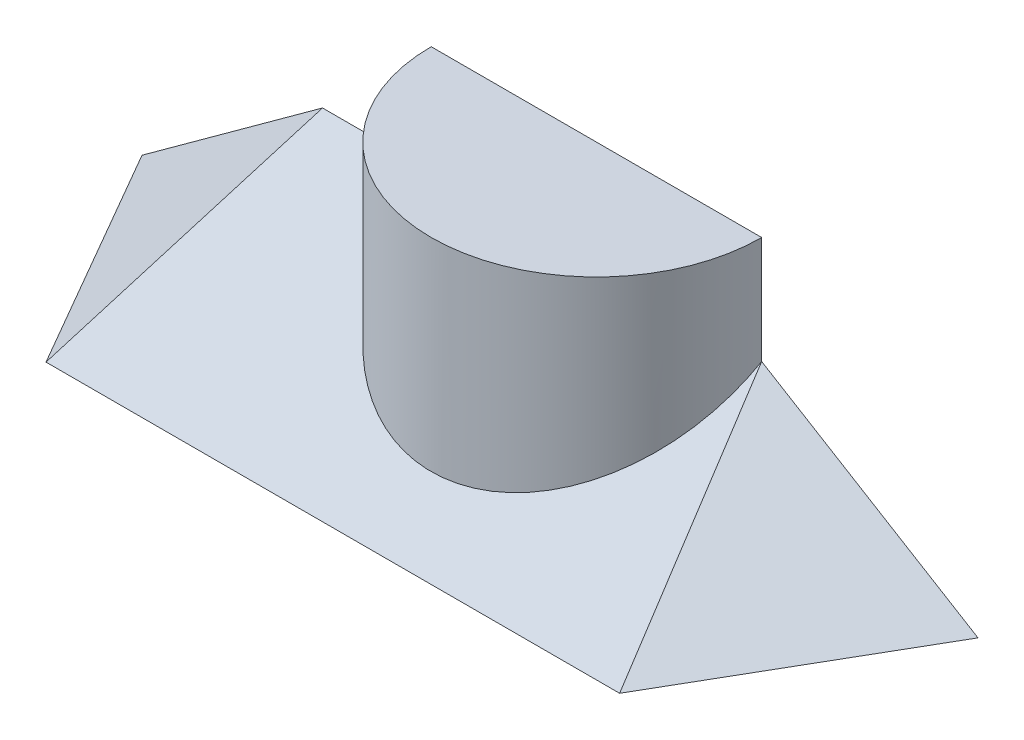
ISO-10303-21;
HEADER;
FILE_DESCRIPTION(('STEP AP214'),'2;1');
FILE_NAME('part.step','',(''),(''),'','','');
FILE_SCHEMA(('AUTOMOTIVE_DESIGN { 1 0 10303 214 1 1 1 1 }'));
ENDSEC;
DATA;
#1=APPLICATION_CONTEXT('core data for automotive mechanical design processes');
#2=APPLICATION_PROTOCOL_DEFINITION('international standard','automotive_design',2000,#1);
#3=PRODUCT_CONTEXT('',#1,'mechanical');
#4=PRODUCT('Part','Part','',(#3));
#5=PRODUCT_RELATED_PRODUCT_CATEGORY('part','',(#4));
#6=PRODUCT_DEFINITION_FORMATION('','',#4);
#7=PRODUCT_DEFINITION_CONTEXT('part definition',#1,'design');
#8=PRODUCT_DEFINITION('design','',#6,#7);
#9=PRODUCT_DEFINITION_SHAPE('','',#8);
#10=(LENGTH_UNIT() NAMED_UNIT(*) SI_UNIT(.MILLI.,.METRE.));
#11=(NAMED_UNIT(*) PLANE_ANGLE_UNIT() SI_UNIT($,.RADIAN.));
#12=(NAMED_UNIT(*) SI_UNIT($,.STERADIAN.) SOLID_ANGLE_UNIT());
#13=UNCERTAINTY_MEASURE_WITH_UNIT(LENGTH_MEASURE(1.E-05),#10,'distance_accuracy_value','');
#14=(GEOMETRIC_REPRESENTATION_CONTEXT(3) GLOBAL_UNCERTAINTY_ASSIGNED_CONTEXT((#13)) GLOBAL_UNIT_ASSIGNED_CONTEXT((#10,
#11,#12)) REPRESENTATION_CONTEXT('',''));
#15=CARTESIAN_POINT('',(0.,0.,0.));
#16=DIRECTION('',(0.,0.,1.));
#17=DIRECTION('',(1.,0.,0.));
#18=AXIS2_PLACEMENT_3D('',#15,#16,#17);
#19=CARTESIAN_POINT('',(-78.25,31.754264805429,0.));
#20=DIRECTION('',(0.,0.866025403784442,0.499999999999995));
#21=DIRECTION('',(0.,-0.499999999999995,0.866025403784442));
#22=AXIS2_PLACEMENT_3D('',#19,#20,#21);
#23=PLANE('',#22);
#24=DIRECTION('',(-1.,0.,0.));
#25=VECTOR('',#24,1.);
#26=CARTESIAN_POINT('',(-78.25,31.7531986040715,0.00184671492222538));
#27=LINE('',#26,#25);
#28=CARTESIAN_POINT('',(40.000692053466,31.7531986040716,0.0018467149222115));
#29=VERTEX_POINT('',#28);
#30=CARTESIAN_POINT('',(39.9999999573705,31.7531986040715,0.00184671492222538));
#31=VERTEX_POINT('',#30);
#32=EDGE_CURVE('E52',#29,#31,#27,.T.);
#33=ORIENTED_EDGE('',*,*,#32,.T.);
#34=CARTESIAN_POINT('',(0.,31.754264805429,0.));
#35=DIRECTION('',(0.,0.866025403784442,0.499999999999995));
#36=DIRECTION('',(0.,-0.499999999999995,0.866025403784442));
#37=AXIS2_PLACEMENT_3D('',#34,#35,#36);
#38=ELLIPSE('',#37,46.1880215351699,40.);
#39=CARTESIAN_POINT('',(-39.9999999573705,31.7531986040716,0.00184671492222538));
#40=VERTEX_POINT('',#39);
#41=EDGE_CURVE('E107',#31,#40,#38,.F.);
#42=ORIENTED_EDGE('',*,*,#41,.T.);
#43=CARTESIAN_POINT('',(-66.3070340950467,31.7531986040715,0.00184671492223232));
#44=VERTEX_POINT('',#43);
#45=EDGE_CURVE('E118',#40,#44,#27,.T.);
#46=ORIENTED_EDGE('',*,*,#45,.T.);
#47=DIRECTION('',(0.184819464600236,0.491386244594021,-0.851105941777325));
#48=VECTOR('',#47,1.);
#49=CARTESIAN_POINT('',(-78.2504292636308,-0.00114129885577733,55.0019767876049));
#50=LINE('',#49,#48);
#51=CARTESIAN_POINT('',(-78.25,0.,55.));
#52=VERTEX_POINT('',#51);
#53=EDGE_CURVE('E123',#52,#44,#50,.T.);
#54=ORIENTED_EDGE('',*,*,#53,.F.);
#55=DIRECTION('',(1.,0.,0.));
#56=VECTOR('',#55,1.);
#57=CARTESIAN_POINT('',(-78.25,0.,55.));
#58=LINE('',#57,#56);
#59=CARTESIAN_POINT('',(60.611162108447,0.,55.0000000000001));
#60=VERTEX_POINT('',#59);
#61=EDGE_CURVE('E132',#52,#60,#58,.T.);
#62=ORIENTED_EDGE('',*,*,#61,.T.);
#63=DIRECTION('',(0.30869171825617,-0.475581071711237,0.823730579321932));
#64=VECTOR('',#63,1.);
#65=CARTESIAN_POINT('',(52.8210519616095,12.0017114592854,34.2124259747358));
#66=LINE('',#65,#64);
#67=EDGE_CURVE('E135',#29,#60,#66,.T.);
#68=ORIENTED_EDGE('',*,*,#67,.F.);
#69=EDGE_LOOP('',(#33,#42,#46,#54,#62,#68));
#70=FACE_BOUND('',#69,.T.);
#71=ADVANCED_FACE('F30',(#70),#23,.T.);
#72=CARTESIAN_POINT('',(-110.003198604072,31.754264805429,0.00184671492222538));
#73=DIRECTION('',(0.,0.,-1.));
#74=DIRECTION('',(-1.,0.,0.));
#75=AXIS2_PLACEMENT_3D('',#72,#73,#74);
#76=PLANE('',#75);
#77=DIRECTION('',(1.,0.,0.));
#78=VECTOR('',#77,1.);
#79=CARTESIAN_POINT('',(-110.003198604072,0.,0.00184671492222538));
#80=LINE('',#79,#78);
#81=CARTESIAN_POINT('',(40.,0.,0.00184671492222538));
#82=VERTEX_POINT('',#81);
#83=CARTESIAN_POINT('',(92.3643607125194,0.,0.00184671492221497));
#84=VERTEX_POINT('',#83);
#85=EDGE_CURVE('E111',#82,#84,#80,.T.);
#86=ORIENTED_EDGE('',*,*,#85,.F.);
#87=DIRECTION('',(0.,-1.,0.));
#88=VECTOR('',#87,1.);
#89=CARTESIAN_POINT('',(39.9999999573705,57.75,0.00184671492222538));
#90=LINE('',#89,#88);
#91=EDGE_CURVE('E11',#82,#31,#90,.F.);
#92=ORIENTED_EDGE('',*,*,#91,.T.);
#93=ORIENTED_EDGE('',*,*,#32,.F.);
#94=DIRECTION('',(0.855070113272874,-0.518512392703891,0.));
#95=VECTOR('',#94,1.);
#96=CARTESIAN_POINT('',(12.8390527276605,48.2239492220259,0.00184671492221844));
#97=LINE('',#96,#95);
#98=EDGE_CURVE('E137',#29,#84,#97,.T.);
#99=ORIENTED_EDGE('',*,*,#98,.T.);
#100=EDGE_LOOP('',(#86,#92,#93,#99));
#101=FACE_BOUND('',#100,.T.);
#102=ADVANCED_FACE('F150',(#101),#76,.T.);
#103=ORIENTED_EDGE('',*,*,#45,.F.);
#104=DIRECTION('',(0.,-1.,0.));
#105=VECTOR('',#104,1.);
#106=CARTESIAN_POINT('',(-39.9999999573705,57.75,0.00184671492222538));
#107=LINE('',#106,#105);
#108=CARTESIAN_POINT('',(-39.9999999573705,0.,0.00184671492222538));
#109=VERTEX_POINT('',#108);
#110=EDGE_CURVE('E38',#40,#109,#107,.T.);
#111=ORIENTED_EDGE('',*,*,#110,.T.);
#112=CARTESIAN_POINT('',(-110.003198604072,0.,0.00184671492222538));
#113=VERTEX_POINT('',#112);
#114=EDGE_CURVE('E116',#113,#109,#80,.T.);
#115=ORIENTED_EDGE('',*,*,#114,.F.);
#116=DIRECTION('',(0.808963493304016,0.587858883152549,0.));
#117=VECTOR('',#116,1.);
#118=CARTESIAN_POINT('',(-89.222030105823,15.1012927098736,0.00184671492222538));
#119=LINE('',#118,#117);
#120=EDGE_CURVE('E120',#113,#44,#119,.T.);
#121=ORIENTED_EDGE('',*,*,#120,.T.);
#122=EDGE_LOOP('',(#103,#111,#115,#121));
#123=FACE_BOUND('',#122,.T.);
#124=ADVANCED_FACE('F141',(#123),#76,.T.);
#125=CARTESIAN_POINT('',(-78.25,0.,55.));
#126=DIRECTION('',(0.,-1.,0.));
#127=DIRECTION('',(0.,0.,-1.));
#128=AXIS2_PLACEMENT_3D('',#125,#126,#127);
#129=PLANE('',#128);
#130=CARTESIAN_POINT('',(0.,0.,0.));
#131=DIRECTION('',(0.,1.,0.));
#132=DIRECTION('',(0.,0.,1.));
#133=AXIS2_PLACEMENT_3D('',#130,#131,#132);
#134=CIRCLE('',#133,40.);
#135=CARTESIAN_POINT('',(40.,0.,0.));
#136=VERTEX_POINT('',#135);
#137=EDGE_CURVE('E45',#82,#136,#134,.T.);
#138=ORIENTED_EDGE('',*,*,#137,.F.);
#139=ORIENTED_EDGE('',*,*,#85,.T.);
#140=DIRECTION('',(0.500000000000004,0.,-0.866025403784436));
#141=VECTOR('',#140,1.);
#142=CARTESIAN_POINT('',(42.1259471933589,0.,87.0173314217623));
#143=LINE('',#142,#141);
#144=EDGE_CURVE('E126',#60,#84,#143,.T.);
#145=ORIENTED_EDGE('',*,*,#144,.F.);
#146=ORIENTED_EDGE('',*,*,#61,.F.);
#147=DIRECTION('',(-0.500000000000005,0.,-0.866025403784436));
#148=VECTOR('',#147,1.);
#149=CARTESIAN_POINT('',(-78.2481986040721,0.,55.0031201092718));
#150=LINE('',#149,#148);
#151=EDGE_CURVE('E129',#52,#113,#150,.T.);
#152=ORIENTED_EDGE('',*,*,#151,.T.);
#153=ORIENTED_EDGE('',*,*,#114,.T.);
#154=CARTESIAN_POINT('',(-40.,0.,0.));
#155=VERTEX_POINT('',#154);
#156=EDGE_CURVE('E94',#155,#109,#134,.T.);
#157=ORIENTED_EDGE('',*,*,#156,.F.);
#158=DIRECTION('',(-1.,0.,0.));
#159=VECTOR('',#158,1.);
#160=CARTESIAN_POINT('',(40.,0.,0.));
#161=LINE('',#160,#159);
#162=EDGE_CURVE('E97',#136,#155,#161,.T.);
#163=ORIENTED_EDGE('',*,*,#162,.F.);
#164=EDGE_LOOP('',(#138,#139,#145,#146,#152,#153,#157,#163));
#165=FACE_BOUND('',#164,.T.);
#166=ADVANCED_FACE('F32',(#165),#129,.T.);
#167=CARTESIAN_POINT('',(-78.2481986040721,0.,55.0031201092718));
#168=DIRECTION('',(0.556670399226414,-0.766044443118982,-0.321393804843271));
#169=DIRECTION('',(0.808963493304016,0.587858883152549,0.));
#170=AXIS2_PLACEMENT_3D('',#167,#168,#169);
#171=PLANE('',#170);
#172=ORIENTED_EDGE('',*,*,#120,.F.);
#173=ORIENTED_EDGE('',*,*,#151,.F.);
#174=ORIENTED_EDGE('',*,*,#53,.T.);
#175=EDGE_LOOP('',(#172,#173,#174));
#176=FACE_BOUND('',#175,.T.);
#177=ADVANCED_FACE('F147',(#176),#171,.F.);
#178=CARTESIAN_POINT('',(2.85187700795152,31.754264805429,64.3424364280449));
#179=DIRECTION('',(-0.496731764892154,-0.819152044288991,-0.286788218175526));
#180=DIRECTION('',(0.855070113272874,-0.518512392703891,0.));
#181=AXIS2_PLACEMENT_3D('',#178,#179,#180);
#182=PLANE('',#181);
#183=ORIENTED_EDGE('',*,*,#98,.F.);
#184=ORIENTED_EDGE('',*,*,#67,.T.);
#185=ORIENTED_EDGE('',*,*,#144,.T.);
#186=EDGE_LOOP('',(#183,#184,#185));
#187=FACE_BOUND('',#186,.T.);
#188=ADVANCED_FACE('F152',(#187),#182,.F.);
#189=CARTESIAN_POINT('',(0.,57.75,0.));
#190=DIRECTION('',(0.,-1.,0.));
#191=DIRECTION('',(0.,0.,-1.));
#192=AXIS2_PLACEMENT_3D('',#189,#190,#191);
#193=CYLINDRICAL_SURFACE('',#192,40.);
#194=ORIENTED_EDGE('',*,*,#91,.F.);
#195=ORIENTED_EDGE('',*,*,#137,.T.);
#196=DIRECTION('',(0.,-1.,0.));
#197=VECTOR('',#196,1.);
#198=CARTESIAN_POINT('',(40.,57.75,0.));
#199=LINE('',#198,#197);
#200=CARTESIAN_POINT('',(40.,57.75,0.));
#201=VERTEX_POINT('',#200);
#202=EDGE_CURVE('E92',#201,#136,#199,.T.);
#203=ORIENTED_EDGE('',*,*,#202,.F.);
#204=CARTESIAN_POINT('',(0.,57.75,0.));
#205=DIRECTION('',(0.,1.,0.));
#206=DIRECTION('',(0.,0.,1.));
#207=AXIS2_PLACEMENT_3D('',#204,#205,#206);
#208=CIRCLE('',#207,40.);
#209=CARTESIAN_POINT('',(-40.,57.75,0.));
#210=VERTEX_POINT('',#209);
#211=EDGE_CURVE('E102',#210,#201,#208,.T.);
#212=ORIENTED_EDGE('',*,*,#211,.F.);
#213=DIRECTION('',(0.,-1.,0.));
#214=VECTOR('',#213,1.);
#215=CARTESIAN_POINT('',(-40.,57.75,0.));
#216=LINE('',#215,#214);
#217=EDGE_CURVE('E108',#210,#155,#216,.T.);
#218=ORIENTED_EDGE('',*,*,#217,.T.);
#219=ORIENTED_EDGE('',*,*,#156,.T.);
#220=ORIENTED_EDGE('',*,*,#110,.F.);
#221=ORIENTED_EDGE('',*,*,#41,.F.);
#222=EDGE_LOOP('',(#194,#195,#203,#212,#218,#219,#220,#221));
#223=FACE_BOUND('',#222,.T.);
#224=ADVANCED_FACE('F89',(#223),#193,.T.);
#225=CARTESIAN_POINT('',(40.,57.75,0.));
#226=DIRECTION('',(0.,0.,1.));
#227=DIRECTION('',(1.,0.,0.));
#228=AXIS2_PLACEMENT_3D('',#225,#226,#227);
#229=PLANE('',#228);
#230=ORIENTED_EDGE('',*,*,#162,.T.);
#231=ORIENTED_EDGE('',*,*,#217,.F.);
#232=DIRECTION('',(-1.,0.,0.));
#233=VECTOR('',#232,1.);
#234=CARTESIAN_POINT('',(40.,57.75,0.));
#235=LINE('',#234,#233);
#236=EDGE_CURVE('E105',#201,#210,#235,.T.);
#237=ORIENTED_EDGE('',*,*,#236,.F.);
#238=ORIENTED_EDGE('',*,*,#202,.T.);
#239=EDGE_LOOP('',(#230,#231,#237,#238));
#240=FACE_BOUND('',#239,.T.);
#241=ADVANCED_FACE('F104',(#240),#229,.F.);
#242=CARTESIAN_POINT('',(0.,57.75,0.));
#243=DIRECTION('',(0.,1.,0.));
#244=DIRECTION('',(0.,0.,1.));
#245=AXIS2_PLACEMENT_3D('',#242,#243,#244);
#246=PLANE('',#245);
#247=ORIENTED_EDGE('',*,*,#211,.T.);
#248=ORIENTED_EDGE('',*,*,#236,.T.);
#249=EDGE_LOOP('',(#247,#248));
#250=FACE_BOUND('',#249,.T.);
#251=ADVANCED_FACE('F172',(#250),#246,.T.);
#252=CLOSED_SHELL('',(#71,#102,#124,#166,#177,#188,#224,#241,#251));
#253=MANIFOLD_SOLID_BREP('B2',#252);
#254=ADVANCED_BREP_SHAPE_REPRESENTATION('',(#18,#253),#14);
#255=SHAPE_DEFINITION_REPRESENTATION(#9,#254);
ENDSEC;
END-ISO-10303-21;
